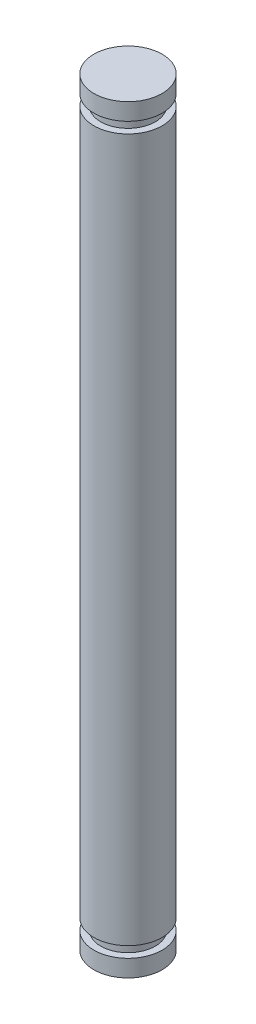
ISO-10303-21;
HEADER;
FILE_DESCRIPTION(('STEP AP214'),'2;1');
FILE_NAME('part.step','',(''),(''),'','','');
FILE_SCHEMA(('AUTOMOTIVE_DESIGN { 1 0 10303 214 1 1 1 1 }'));
ENDSEC;
DATA;
#1=APPLICATION_CONTEXT('core data for automotive mechanical design processes');
#2=APPLICATION_PROTOCOL_DEFINITION('international standard','automotive_design',2000,#1);
#3=PRODUCT_CONTEXT('',#1,'mechanical');
#4=PRODUCT('Part','Part','',(#3));
#5=PRODUCT_RELATED_PRODUCT_CATEGORY('part','',(#4));
#6=PRODUCT_DEFINITION_FORMATION('','',#4);
#7=PRODUCT_DEFINITION_CONTEXT('part definition',#1,'design');
#8=PRODUCT_DEFINITION('design','',#6,#7);
#9=PRODUCT_DEFINITION_SHAPE('','',#8);
#10=(LENGTH_UNIT() NAMED_UNIT(*) SI_UNIT(.MILLI.,.METRE.));
#11=(NAMED_UNIT(*) PLANE_ANGLE_UNIT() SI_UNIT($,.RADIAN.));
#12=(NAMED_UNIT(*) SI_UNIT($,.STERADIAN.) SOLID_ANGLE_UNIT());
#13=UNCERTAINTY_MEASURE_WITH_UNIT(LENGTH_MEASURE(1.E-05),#10,'distance_accuracy_value','');
#14=(GEOMETRIC_REPRESENTATION_CONTEXT(3) GLOBAL_UNCERTAINTY_ASSIGNED_CONTEXT((#13)) GLOBAL_UNIT_ASSIGNED_CONTEXT((#10,
#11,#12)) REPRESENTATION_CONTEXT('',''));
#15=CARTESIAN_POINT('',(0.,0.,0.));
#16=DIRECTION('',(0.,0.,1.));
#17=DIRECTION('',(1.,0.,0.));
#18=AXIS2_PLACEMENT_3D('',#15,#16,#17);
#19=CARTESIAN_POINT('',(0.,0.,0.));
#20=DIRECTION('',(0.,-1.,0.));
#21=DIRECTION('',(0.,0.,-1.));
#22=AXIS2_PLACEMENT_3D('',#19,#20,#21);
#23=CYLINDRICAL_SURFACE('',#22,2.);
#24=CARTESIAN_POINT('',(0.,42.86,0.));
#25=DIRECTION('',(0.,-1.,0.));
#26=DIRECTION('',(0.,0.,-1.));
#27=AXIS2_PLACEMENT_3D('',#24,#25,#26);
#28=CIRCLE('',#27,2.);
#29=CARTESIAN_POINT('',(0.,42.86,-2.));
#30=VERTEX_POINT('',#29);
#31=EDGE_CURVE('E47',#30,#30,#28,.F.);
#32=ORIENTED_EDGE('',*,*,#31,.F.);
#33=EDGE_LOOP('',(#32));
#34=FACE_BOUND('',#33,.T.);
#35=CARTESIAN_POINT('',(0.,1.64,0.));
#36=DIRECTION('',(0.,-1.,0.));
#37=DIRECTION('',(0.,0.,-1.));
#38=AXIS2_PLACEMENT_3D('',#35,#36,#37);
#39=CIRCLE('',#38,2.);
#40=CARTESIAN_POINT('',(0.,1.64,-2.));
#41=VERTEX_POINT('',#40);
#42=EDGE_CURVE('E52',#41,#41,#39,.F.);
#43=ORIENTED_EDGE('',*,*,#42,.T.);
#44=EDGE_LOOP('',(#43));
#45=FACE_BOUND('',#44,.T.);
#46=ADVANCED_FACE('F30',(#34,#45),#23,.T.);
#47=CARTESIAN_POINT('',(0.,44.5,0.));
#48=DIRECTION('',(0.,-1.,0.));
#49=DIRECTION('',(0.,0.,-1.));
#50=AXIS2_PLACEMENT_3D('',#47,#48,#49);
#51=CIRCLE('',#50,2.);
#52=CARTESIAN_POINT('',(0.,44.5,-2.));
#53=VERTEX_POINT('',#52);
#54=EDGE_CURVE('E10',#53,#53,#51,.T.);
#55=ORIENTED_EDGE('',*,*,#54,.T.);
#56=EDGE_LOOP('',(#55));
#57=FACE_BOUND('',#56,.T.);
#58=CARTESIAN_POINT('',(0.,43.5,0.));
#59=DIRECTION('',(0.,-1.,0.));
#60=DIRECTION('',(0.,0.,-1.));
#61=AXIS2_PLACEMENT_3D('',#58,#59,#60);
#62=CIRCLE('',#61,2.);
#63=CARTESIAN_POINT('',(0.,43.5,-2.));
#64=VERTEX_POINT('',#63);
#65=EDGE_CURVE('E43',#64,#64,#62,.F.);
#66=ORIENTED_EDGE('',*,*,#65,.T.);
#67=EDGE_LOOP('',(#66));
#68=FACE_BOUND('',#67,.T.);
#69=ADVANCED_FACE('F88',(#57,#68),#23,.T.);
#70=CARTESIAN_POINT('',(0.,44.5,0.));
#71=DIRECTION('',(0.,1.,0.));
#72=DIRECTION('',(0.,0.,1.));
#73=AXIS2_PLACEMENT_3D('',#70,#71,#72);
#74=PLANE('',#73);
#75=ORIENTED_EDGE('',*,*,#54,.F.);
#76=EDGE_LOOP('',(#75));
#77=FACE_BOUND('',#76,.T.);
#78=ADVANCED_FACE('F32',(#77),#74,.T.);
#79=CARTESIAN_POINT('',(2.17483860527878,43.5,0.));
#80=DIRECTION('',(0.,-1.,0.));
#81=DIRECTION('',(0.,0.,-1.));
#82=AXIS2_PLACEMENT_3D('',#79,#80,#81);
#83=PLANE('',#82);
#84=ORIENTED_EDGE('',*,*,#65,.F.);
#85=EDGE_LOOP('',(#84));
#86=FACE_BOUND('',#85,.T.);
#87=CARTESIAN_POINT('',(0.,43.5,0.));
#88=DIRECTION('',(0.,1.,0.));
#89=DIRECTION('',(0.,0.,1.));
#90=AXIS2_PLACEMENT_3D('',#87,#88,#89);
#91=CIRCLE('',#90,1.59999999999999);
#92=CARTESIAN_POINT('',(0.,43.5,1.59999999999999));
#93=VERTEX_POINT('',#92);
#94=EDGE_CURVE('E50',#93,#93,#91,.T.);
#95=ORIENTED_EDGE('',*,*,#94,.T.);
#96=EDGE_LOOP('',(#95));
#97=FACE_BOUND('',#96,.T.);
#98=ADVANCED_FACE('F71',(#86,#97),#83,.T.);
#99=CARTESIAN_POINT('',(0.,44.5,0.));
#100=DIRECTION('',(0.,1.,0.));
#101=DIRECTION('',(0.,0.,1.));
#102=AXIS2_PLACEMENT_3D('',#99,#100,#101);
#103=CYLINDRICAL_SURFACE('',#102,1.59999999999999);
#104=CARTESIAN_POINT('',(0.,42.86,0.));
#105=DIRECTION('',(0.,1.,0.));
#106=DIRECTION('',(0.,0.,1.));
#107=AXIS2_PLACEMENT_3D('',#104,#105,#106);
#108=CIRCLE('',#107,1.59999999999999);
#109=CARTESIAN_POINT('',(0.,42.86,1.59999999999999));
#110=VERTEX_POINT('',#109);
#111=EDGE_CURVE('E58',#110,#110,#108,.T.);
#112=ORIENTED_EDGE('',*,*,#111,.T.);
#113=EDGE_LOOP('',(#112));
#114=FACE_BOUND('',#113,.T.);
#115=ORIENTED_EDGE('',*,*,#94,.F.);
#116=EDGE_LOOP('',(#115));
#117=FACE_BOUND('',#116,.T.);
#118=ADVANCED_FACE('F73',(#114,#117),#103,.T.);
#119=CARTESIAN_POINT('',(2.17483860527878,42.86,0.));
#120=DIRECTION('',(0.,-1.,0.));
#121=DIRECTION('',(0.,0.,-1.));
#122=AXIS2_PLACEMENT_3D('',#119,#120,#121);
#123=PLANE('',#122);
#124=ORIENTED_EDGE('',*,*,#31,.T.);
#125=EDGE_LOOP('',(#124));
#126=FACE_BOUND('',#125,.T.);
#127=ORIENTED_EDGE('',*,*,#111,.F.);
#128=EDGE_LOOP('',(#127));
#129=FACE_BOUND('',#128,.T.);
#130=ADVANCED_FACE('F75',(#126,#129),#123,.F.);
#131=CARTESIAN_POINT('',(0.,44.5,0.));
#132=DIRECTION('',(0.,1.,0.));
#133=DIRECTION('',(0.,0.,1.));
#134=AXIS2_PLACEMENT_3D('',#131,#132,#133);
#135=CYLINDRICAL_SURFACE('',#134,1.6);
#136=CARTESIAN_POINT('',(0.,1.,0.));
#137=DIRECTION('',(0.,1.,0.));
#138=DIRECTION('',(0.,0.,1.));
#139=AXIS2_PLACEMENT_3D('',#136,#137,#138);
#140=CIRCLE('',#139,1.6);
#141=CARTESIAN_POINT('',(0.,1.,1.6));
#142=VERTEX_POINT('',#141);
#143=EDGE_CURVE('E54',#142,#142,#140,.T.);
#144=ORIENTED_EDGE('',*,*,#143,.T.);
#145=EDGE_LOOP('',(#144));
#146=FACE_BOUND('',#145,.T.);
#147=CARTESIAN_POINT('',(0.,1.64,0.));
#148=DIRECTION('',(0.,1.,0.));
#149=DIRECTION('',(0.,0.,1.));
#150=AXIS2_PLACEMENT_3D('',#147,#148,#149);
#151=CIRCLE('',#150,1.6);
#152=CARTESIAN_POINT('',(0.,1.64,1.6));
#153=VERTEX_POINT('',#152);
#154=EDGE_CURVE('E60',#153,#153,#151,.T.);
#155=ORIENTED_EDGE('',*,*,#154,.F.);
#156=EDGE_LOOP('',(#155));
#157=FACE_BOUND('',#156,.T.);
#158=ADVANCED_FACE('F82',(#146,#157),#135,.T.);
#159=CARTESIAN_POINT('',(1.6,1.,0.));
#160=DIRECTION('',(0.,1.,0.));
#161=DIRECTION('',(0.,0.,1.));
#162=AXIS2_PLACEMENT_3D('',#159,#160,#161);
#163=PLANE('',#162);
#164=CARTESIAN_POINT('',(0.,1.,0.));
#165=DIRECTION('',(0.,1.,0.));
#166=DIRECTION('',(0.,0.,1.));
#167=AXIS2_PLACEMENT_3D('',#164,#165,#166);
#168=CIRCLE('',#167,2.);
#169=CARTESIAN_POINT('',(0.,1.,2.));
#170=VERTEX_POINT('',#169);
#171=EDGE_CURVE('E34',#170,#170,#168,.F.);
#172=ORIENTED_EDGE('',*,*,#171,.F.);
#173=EDGE_LOOP('',(#172));
#174=FACE_BOUND('',#173,.T.);
#175=ORIENTED_EDGE('',*,*,#143,.F.);
#176=EDGE_LOOP('',(#175));
#177=FACE_BOUND('',#176,.T.);
#178=ADVANCED_FACE('F108',(#174,#177),#163,.T.);
#179=CARTESIAN_POINT('',(1.6,1.64,0.));
#180=DIRECTION('',(0.,-1.,0.));
#181=DIRECTION('',(0.,0.,-1.));
#182=AXIS2_PLACEMENT_3D('',#179,#180,#181);
#183=PLANE('',#182);
#184=ORIENTED_EDGE('',*,*,#42,.F.);
#185=EDGE_LOOP('',(#184));
#186=FACE_BOUND('',#185,.T.);
#187=ORIENTED_EDGE('',*,*,#154,.T.);
#188=EDGE_LOOP('',(#187));
#189=FACE_BOUND('',#188,.T.);
#190=ADVANCED_FACE('F102',(#186,#189),#183,.T.);
#191=CARTESIAN_POINT('',(0.,0.,0.));
#192=DIRECTION('',(0.,-1.,0.));
#193=DIRECTION('',(0.,0.,-1.));
#194=AXIS2_PLACEMENT_3D('',#191,#192,#193);
#195=PLANE('',#194);
#196=CARTESIAN_POINT('',(0.,0.,0.));
#197=DIRECTION('',(0.,-1.,0.));
#198=DIRECTION('',(0.,0.,-1.));
#199=AXIS2_PLACEMENT_3D('',#196,#197,#198);
#200=CIRCLE('',#199,2.);
#201=CARTESIAN_POINT('',(0.,0.,-2.));
#202=VERTEX_POINT('',#201);
#203=EDGE_CURVE('E38',#202,#202,#200,.T.);
#204=ORIENTED_EDGE('',*,*,#203,.T.);
#205=EDGE_LOOP('',(#204));
#206=FACE_BOUND('',#205,.T.);
#207=ADVANCED_FACE('F97',(#206),#195,.T.);
#208=ORIENTED_EDGE('',*,*,#203,.F.);
#209=EDGE_LOOP('',(#208));
#210=FACE_BOUND('',#209,.T.);
#211=ORIENTED_EDGE('',*,*,#171,.T.);
#212=EDGE_LOOP('',(#211));
#213=FACE_BOUND('',#212,.T.);
#214=ADVANCED_FACE('F90',(#210,#213),#23,.T.);
#215=CLOSED_SHELL('',(#46,#69,#78,#98,#118,#130,#158,#178,#190,#207,#214));
#216=MANIFOLD_SOLID_BREP('B2',#215);
#217=ADVANCED_BREP_SHAPE_REPRESENTATION('',(#18,#216),#14);
#218=SHAPE_DEFINITION_REPRESENTATION(#9,#217);
ENDSEC;
END-ISO-10303-21;
